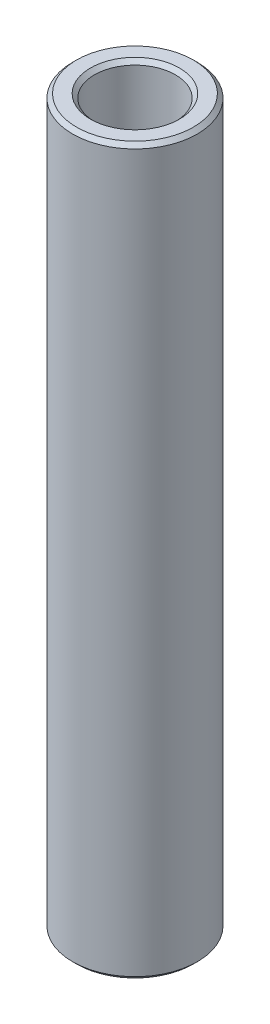
ISO-10303-21;
HEADER;
FILE_DESCRIPTION(('STEP AP214'),'2;1');
FILE_NAME('part.step','',(''),(''),'','','');
FILE_SCHEMA(('AUTOMOTIVE_DESIGN { 1 0 10303 214 1 1 1 1 }'));
ENDSEC;
DATA;
#1=APPLICATION_CONTEXT('core data for automotive mechanical design processes');
#2=APPLICATION_PROTOCOL_DEFINITION('international standard','automotive_design',2000,#1);
#3=PRODUCT_CONTEXT('',#1,'mechanical');
#4=PRODUCT('Part','Part','',(#3));
#5=PRODUCT_RELATED_PRODUCT_CATEGORY('part','',(#4));
#6=PRODUCT_DEFINITION_FORMATION('','',#4);
#7=PRODUCT_DEFINITION_CONTEXT('part definition',#1,'design');
#8=PRODUCT_DEFINITION('design','',#6,#7);
#9=PRODUCT_DEFINITION_SHAPE('','',#8);
#10=(LENGTH_UNIT() NAMED_UNIT(*) SI_UNIT(.MILLI.,.METRE.));
#11=(NAMED_UNIT(*) PLANE_ANGLE_UNIT() SI_UNIT($,.RADIAN.));
#12=(NAMED_UNIT(*) SI_UNIT($,.STERADIAN.) SOLID_ANGLE_UNIT());
#13=UNCERTAINTY_MEASURE_WITH_UNIT(LENGTH_MEASURE(1.E-05),#10,'distance_accuracy_value','');
#14=(GEOMETRIC_REPRESENTATION_CONTEXT(3) GLOBAL_UNCERTAINTY_ASSIGNED_CONTEXT((#13)) GLOBAL_UNIT_ASSIGNED_CONTEXT((#10,
#11,#12)) REPRESENTATION_CONTEXT('',''));
#15=CARTESIAN_POINT('',(0.,0.,0.));
#16=DIRECTION('',(0.,0.,1.));
#17=DIRECTION('',(1.,0.,0.));
#18=AXIS2_PLACEMENT_3D('',#15,#16,#17);
#19=CARTESIAN_POINT('',(0.,9.6155583234771,0.));
#20=DIRECTION('',(0.,1.,0.));
#21=DIRECTION('',(0.,0.,1.));
#22=AXIS2_PLACEMENT_3D('',#19,#20,#21);
#23=CYLINDRICAL_SURFACE('',#22,1.3);
#24=CARTESIAN_POINT('',(0.,-11.51001,0.));
#25=DIRECTION('',(0.,1.,0.));
#26=DIRECTION('',(0.,0.,1.));
#27=AXIS2_PLACEMENT_3D('',#24,#25,#26);
#28=CIRCLE('',#27,1.3);
#29=CARTESIAN_POINT('',(0.,-11.51001,1.3));
#30=VERTEX_POINT('',#29);
#31=EDGE_CURVE('E50',#30,#30,#28,.F.);
#32=ORIENTED_EDGE('',*,*,#31,.T.);
#33=EDGE_LOOP('',(#32));
#34=FACE_BOUND('',#33,.T.);
#35=CARTESIAN_POINT('',(0.,11.51001,0.));
#36=DIRECTION('',(0.,-1.,0.));
#37=DIRECTION('',(0.,0.,-1.));
#38=AXIS2_PLACEMENT_3D('',#35,#36,#37);
#39=CIRCLE('',#38,1.3);
#40=CARTESIAN_POINT('',(0.,11.51001,-1.3));
#41=VERTEX_POINT('',#40);
#42=EDGE_CURVE('E53',#41,#41,#39,.F.);
#43=ORIENTED_EDGE('',*,*,#42,.T.);
#44=EDGE_LOOP('',(#43));
#45=FACE_BOUND('',#44,.T.);
#46=ADVANCED_FACE('F30',(#34,#45),#23,.F.);
#47=CARTESIAN_POINT('',(1.3,-11.63701,0.));
#48=DIRECTION('',(0.,1.,0.));
#49=DIRECTION('',(0.,0.,1.));
#50=AXIS2_PLACEMENT_3D('',#47,#48,#49);
#51=PLANE('',#50);
#52=CARTESIAN_POINT('',(0.,-11.63701,0.));
#53=DIRECTION('',(0.,1.,0.));
#54=DIRECTION('',(0.,0.,1.));
#55=AXIS2_PLACEMENT_3D('',#52,#53,#54);
#56=CIRCLE('',#55,1.42700000000001);
#57=CARTESIAN_POINT('',(0.,-11.63701,1.42700000000001));
#58=VERTEX_POINT('',#57);
#59=EDGE_CURVE('E56',#58,#58,#56,.T.);
#60=ORIENTED_EDGE('',*,*,#59,.T.);
#61=EDGE_LOOP('',(#60));
#62=FACE_BOUND('',#61,.T.);
#63=CARTESIAN_POINT('',(0.,-11.63701,0.));
#64=DIRECTION('',(0.,1.,0.));
#65=DIRECTION('',(0.,0.,1.));
#66=AXIS2_PLACEMENT_3D('',#63,#64,#65);
#67=CIRCLE('',#66,1.873);
#68=CARTESIAN_POINT('',(0.,-11.63701,1.873));
#69=VERTEX_POINT('',#68);
#70=EDGE_CURVE('E59',#69,#69,#67,.F.);
#71=ORIENTED_EDGE('',*,*,#70,.T.);
#72=EDGE_LOOP('',(#71));
#73=FACE_BOUND('',#72,.T.);
#74=ADVANCED_FACE('F63',(#62,#73),#51,.F.);
#75=CARTESIAN_POINT('',(0.,9.6155583234771,0.));
#76=DIRECTION('',(0.,1.,0.));
#77=DIRECTION('',(0.,0.,1.));
#78=AXIS2_PLACEMENT_3D('',#75,#76,#77);
#79=CYLINDRICAL_SURFACE('',#78,2.);
#80=CARTESIAN_POINT('',(0.,-11.51001,0.));
#81=DIRECTION('',(0.,1.,0.));
#82=DIRECTION('',(0.,0.,1.));
#83=AXIS2_PLACEMENT_3D('',#80,#81,#82);
#84=CIRCLE('',#83,2.);
#85=CARTESIAN_POINT('',(0.,-11.51001,2.));
#86=VERTEX_POINT('',#85);
#87=EDGE_CURVE('E41',#86,#86,#84,.T.);
#88=ORIENTED_EDGE('',*,*,#87,.T.);
#89=EDGE_LOOP('',(#88));
#90=FACE_BOUND('',#89,.T.);
#91=CARTESIAN_POINT('',(0.,11.51001,0.));
#92=DIRECTION('',(0.,-1.,0.));
#93=DIRECTION('',(0.,0.,-1.));
#94=AXIS2_PLACEMENT_3D('',#91,#92,#93);
#95=CIRCLE('',#94,2.);
#96=CARTESIAN_POINT('',(0.,11.51001,-2.));
#97=VERTEX_POINT('',#96);
#98=EDGE_CURVE('E45',#97,#97,#95,.T.);
#99=ORIENTED_EDGE('',*,*,#98,.T.);
#100=EDGE_LOOP('',(#99));
#101=FACE_BOUND('',#100,.T.);
#102=ADVANCED_FACE('F73',(#90,#101),#79,.T.);
#103=CARTESIAN_POINT('',(2.,11.63701,0.));
#104=DIRECTION('',(0.,-1.,0.));
#105=DIRECTION('',(0.,0.,-1.));
#106=AXIS2_PLACEMENT_3D('',#103,#104,#105);
#107=PLANE('',#106);
#108=CARTESIAN_POINT('',(0.,11.63701,0.));
#109=DIRECTION('',(0.,-1.,0.));
#110=DIRECTION('',(0.,0.,-1.));
#111=AXIS2_PLACEMENT_3D('',#108,#109,#110);
#112=CIRCLE('',#111,1.873);
#113=CARTESIAN_POINT('',(0.,11.63701,-1.873));
#114=VERTEX_POINT('',#113);
#115=EDGE_CURVE('E10',#114,#114,#112,.F.);
#116=ORIENTED_EDGE('',*,*,#115,.T.);
#117=EDGE_LOOP('',(#116));
#118=FACE_BOUND('',#117,.T.);
#119=CARTESIAN_POINT('',(0.,11.63701,0.));
#120=DIRECTION('',(0.,-1.,0.));
#121=DIRECTION('',(0.,0.,-1.));
#122=AXIS2_PLACEMENT_3D('',#119,#120,#121);
#123=CIRCLE('',#122,1.427);
#124=CARTESIAN_POINT('',(0.,11.63701,-1.427));
#125=VERTEX_POINT('',#124);
#126=EDGE_CURVE('E37',#125,#125,#123,.T.);
#127=ORIENTED_EDGE('',*,*,#126,.T.);
#128=EDGE_LOOP('',(#127));
#129=FACE_BOUND('',#128,.T.);
#130=ADVANCED_FACE('F76',(#118,#129),#107,.F.);
#131=CARTESIAN_POINT('',(0.,-11.63701,0.));
#132=DIRECTION('',(0.,-1.,0.));
#133=DIRECTION('',(0.,0.,-1.));
#134=AXIS2_PLACEMENT_3D('',#131,#132,#133);
#135=CONICAL_SURFACE('',#134,1.427,0.785398163397448);
#136=ORIENTED_EDGE('',*,*,#31,.F.);
#137=EDGE_LOOP('',(#136));
#138=FACE_BOUND('',#137,.T.);
#139=ORIENTED_EDGE('',*,*,#59,.F.);
#140=EDGE_LOOP('',(#139));
#141=FACE_BOUND('',#140,.T.);
#142=ADVANCED_FACE('F69',(#138,#141),#135,.F.);
#143=CARTESIAN_POINT('',(0.,-11.51001,0.));
#144=DIRECTION('',(0.,1.,0.));
#145=DIRECTION('',(0.,0.,1.));
#146=AXIS2_PLACEMENT_3D('',#143,#144,#145);
#147=CONICAL_SURFACE('',#146,2.,0.785398163397458);
#148=ORIENTED_EDGE('',*,*,#70,.F.);
#149=EDGE_LOOP('',(#148));
#150=FACE_BOUND('',#149,.T.);
#151=ORIENTED_EDGE('',*,*,#87,.F.);
#152=EDGE_LOOP('',(#151));
#153=FACE_BOUND('',#152,.T.);
#154=ADVANCED_FACE('F65',(#150,#153),#147,.T.);
#155=CARTESIAN_POINT('',(0.,11.63701,0.));
#156=DIRECTION('',(0.,-1.,0.));
#157=DIRECTION('',(0.,0.,-1.));
#158=AXIS2_PLACEMENT_3D('',#155,#156,#157);
#159=CONICAL_SURFACE('',#158,1.873,0.785398163397445);
#160=ORIENTED_EDGE('',*,*,#98,.F.);
#161=EDGE_LOOP('',(#160));
#162=FACE_BOUND('',#161,.T.);
#163=ORIENTED_EDGE('',*,*,#115,.F.);
#164=EDGE_LOOP('',(#163));
#165=FACE_BOUND('',#164,.T.);
#166=ADVANCED_FACE('F68',(#162,#165),#159,.T.);
#167=CARTESIAN_POINT('',(0.,11.51001,0.));
#168=DIRECTION('',(0.,1.,0.));
#169=DIRECTION('',(0.,0.,1.));
#170=AXIS2_PLACEMENT_3D('',#167,#168,#169);
#171=CONICAL_SURFACE('',#170,1.3,0.785398163397455);
#172=ORIENTED_EDGE('',*,*,#126,.F.);
#173=EDGE_LOOP('',(#172));
#174=FACE_BOUND('',#173,.T.);
#175=ORIENTED_EDGE('',*,*,#42,.F.);
#176=EDGE_LOOP('',(#175));
#177=FACE_BOUND('',#176,.T.);
#178=ADVANCED_FACE('F32',(#174,#177),#171,.F.);
#179=CLOSED_SHELL('',(#46,#74,#102,#130,#142,#154,#166,#178));
#180=MANIFOLD_SOLID_BREP('B2',#179);
#181=ADVANCED_BREP_SHAPE_REPRESENTATION('',(#18,#180),#14);
#182=SHAPE_DEFINITION_REPRESENTATION(#9,#181);
ENDSEC;
END-ISO-10303-21;
